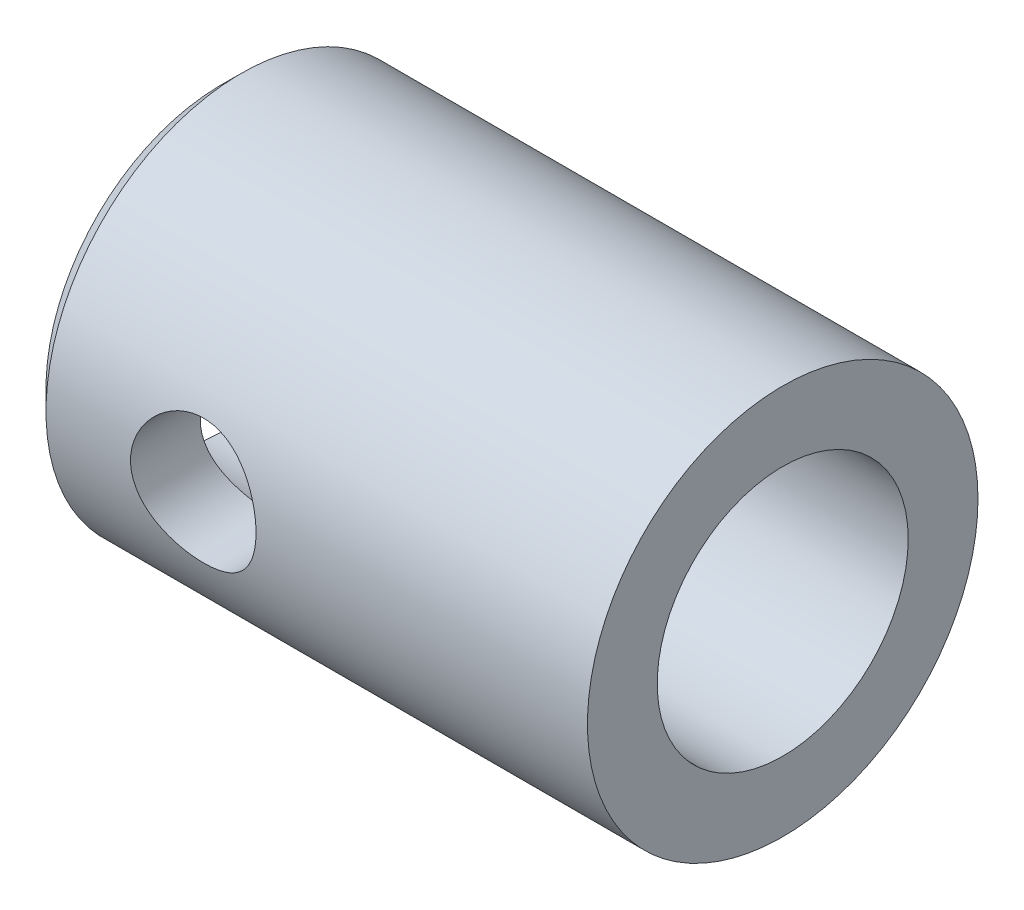
ISO-10303-21;
HEADER;
FILE_DESCRIPTION(('STEP AP214'),'2;1');
FILE_NAME('part.step','',(''),(''),'','','');
FILE_SCHEMA(('AUTOMOTIVE_DESIGN { 1 0 10303 214 1 1 1 1 }'));
ENDSEC;
DATA;
#1=APPLICATION_CONTEXT('core data for automotive mechanical design processes');
#2=APPLICATION_PROTOCOL_DEFINITION('international standard','automotive_design',2000,#1);
#3=PRODUCT_CONTEXT('',#1,'mechanical');
#4=PRODUCT('Part','Part','',(#3));
#5=PRODUCT_RELATED_PRODUCT_CATEGORY('part','',(#4));
#6=PRODUCT_DEFINITION_FORMATION('','',#4);
#7=PRODUCT_DEFINITION_CONTEXT('part definition',#1,'design');
#8=PRODUCT_DEFINITION('design','',#6,#7);
#9=PRODUCT_DEFINITION_SHAPE('','',#8);
#10=(LENGTH_UNIT() NAMED_UNIT(*) SI_UNIT(.MILLI.,.METRE.));
#11=(NAMED_UNIT(*) PLANE_ANGLE_UNIT() SI_UNIT($,.RADIAN.));
#12=(NAMED_UNIT(*) SI_UNIT($,.STERADIAN.) SOLID_ANGLE_UNIT());
#13=UNCERTAINTY_MEASURE_WITH_UNIT(LENGTH_MEASURE(1.E-05),#10,'distance_accuracy_value','');
#14=(GEOMETRIC_REPRESENTATION_CONTEXT(3) GLOBAL_UNCERTAINTY_ASSIGNED_CONTEXT((#13)) GLOBAL_UNIT_ASSIGNED_CONTEXT((#10,
#11,#12)) REPRESENTATION_CONTEXT('',''));
#15=CARTESIAN_POINT('',(0.,0.,0.));
#16=DIRECTION('',(0.,0.,1.));
#17=DIRECTION('',(1.,0.,0.));
#18=AXIS2_PLACEMENT_3D('',#15,#16,#17);
#19=CARTESIAN_POINT('',(42.6212,0.,0.));
#20=DIRECTION('',(-1.,0.,0.));
#21=DIRECTION('',(0.,0.,1.));
#22=AXIS2_PLACEMENT_3D('',#19,#20,#21);
#23=CYLINDRICAL_SURFACE('',#22,14.8209);
#24=CARTESIAN_POINT('',(1.524,0.,0.));
#25=DIRECTION('',(1.,0.,0.));
#26=DIRECTION('',(0.,0.,-1.));
#27=AXIS2_PLACEMENT_3D('',#24,#25,#26);
#28=CIRCLE('',#27,14.8209);
#29=CARTESIAN_POINT('',(1.524,0.,-14.8209));
#30=VERTEX_POINT('',#29);
#31=EDGE_CURVE('E43',#30,#30,#28,.T.);
#32=ORIENTED_EDGE('',*,*,#31,.T.);
#33=EDGE_LOOP('',(#32));
#34=FACE_BOUND('',#33,.T.);
#35=CARTESIAN_POINT('',(17.4625,0.,-14.8209));
#36=CARTESIAN_POINT('',(17.4624994568898,0.260379632540538,-14.8208994870774));
#37=CARTESIAN_POINT('',(17.441076432163,0.520766667672441,-14.8139741654203));
#38=CARTESIAN_POINT('',(17.3561905956567,1.03390288474762,-14.7870276731749));
#39=CARTESIAN_POINT('',(17.2927204390256,1.28665072419858,-14.7670042145936));
#40=CARTESIAN_POINT('',(17.1261181856613,1.77703577522513,-14.7160440036639));
#41=CARTESIAN_POINT('',(17.0230495454601,2.01469645755133,-14.6851247183953));
#42=CARTESIAN_POINT('',(16.7804530953361,2.46936067618328,-14.6155499989599));
#43=CARTESIAN_POINT('',(16.6409189183004,2.68636059595301,-14.5768932140529));
#44=CARTESIAN_POINT('',(16.3245892145734,3.10058748587332,-14.4945288141505));
#45=CARTESIAN_POINT('',(16.1468230676751,3.297050322045,-14.4507065255155));
#46=CARTESIAN_POINT('',(15.7611408847233,3.65795005193175,-14.3636002866809));
#47=CARTESIAN_POINT('',(15.5532188347981,3.82238054220101,-14.3203164457357));
#48=CARTESIAN_POINT('',(15.1064020068003,4.11878189169116,-14.2379444622202));
#49=CARTESIAN_POINT('',(14.8668348736236,4.24978206178781,-14.1989971198325));
#50=CARTESIAN_POINT('',(14.3676161007407,4.46931254458501,-14.1314405143514));
#51=CARTESIAN_POINT('',(14.1079701221452,4.55785477771673,-14.1028283501251));
#52=CARTESIAN_POINT('',(13.5846154886372,4.68713044143014,-14.0603844870467));
#53=CARTESIAN_POINT('',(13.321295088825,4.72928745710386,-14.0461139148853));
#54=CARTESIAN_POINT('',(12.7909617755575,4.76904477457392,-14.0326679681178));
#55=CARTESIAN_POINT('',(12.5239499305168,4.76665770971733,-14.0334883135078));
#56=CARTESIAN_POINT('',(12.0057390692271,4.71850465891803,-14.0497452807499));
#57=CARTESIAN_POINT('',(11.754347424386,4.6745680905365,-14.0645654625477));
#58=CARTESIAN_POINT('',(11.2627125743837,4.54753698121588,-14.1061477920967));
#59=CARTESIAN_POINT('',(11.0224706194958,4.46443806039434,-14.1329112755581));
#60=CARTESIAN_POINT('',(10.5556811118795,4.260188936406,-14.1958231057565));
#61=CARTESIAN_POINT('',(10.3293982047725,4.13847788717477,-14.2321083208656));
#62=CARTESIAN_POINT('',(9.89987678542028,3.8608488278145,-14.3099147211061));
#63=CARTESIAN_POINT('',(9.69664456674573,3.7049215094967,-14.3514373297079));
#64=CARTESIAN_POINT('',(9.3086767060672,3.35438860049305,-14.4374930753061));
#65=CARTESIAN_POINT('',(9.12530831346216,3.15827876765737,-14.4820747598007));
#66=CARTESIAN_POINT('',(8.79371884477358,2.73753927067851,-14.5674628766447));
#67=CARTESIAN_POINT('',(8.6455006796846,2.51290724681063,-14.6082689961472));
#68=CARTESIAN_POINT('',(8.38742081373202,2.03875477190374,-14.6819799442065));
#69=CARTESIAN_POINT('',(8.27790194507404,1.78903586467793,-14.7148133820602));
#70=CARTESIAN_POINT('',(8.10284003410812,1.27341573340948,-14.7683631351214));
#71=CARTESIAN_POINT('',(8.0372828400312,1.00751974704727,-14.7890833494393));
#72=CARTESIAN_POINT('',(7.95437301431391,0.478685957971309,-14.8154368909473));
#73=CARTESIAN_POINT('',(7.93517091289176,0.216066530617194,-14.821648724673));
#74=CARTESIAN_POINT('',(7.94027934253679,-0.308679544883435,-14.8200065948253));
#75=CARTESIAN_POINT('',(7.96458310992208,-0.570806263287368,-14.8121548176646));
#76=CARTESIAN_POINT('',(8.05453715352026,-1.07988052368955,-14.7836486551876));
#77=CARTESIAN_POINT('',(8.11907247572592,-1.3270463011818,-14.7633397363062));
#78=CARTESIAN_POINT('',(8.28628329410422,-1.8069607471473,-14.7123164409879));
#79=CARTESIAN_POINT('',(8.38896357441635,-2.03970760292579,-14.6816007593777));
#80=CARTESIAN_POINT('',(8.63243500501104,-2.49071229522931,-14.6119418282365));
#81=CARTESIAN_POINT('',(8.77412203869248,-2.70845665104474,-14.5728106086226));
#82=CARTESIAN_POINT('',(9.09051970720626,-3.11769139063607,-14.4907801241504));
#83=CARTESIAN_POINT('',(9.26523977927065,-3.30917424470508,-14.4478797843691));
#84=CARTESIAN_POINT('',(9.65144464208988,-3.66881691133028,-14.3608690353941));
#85=CARTESIAN_POINT('',(9.86416636109497,-3.83565756619151,-14.3167835897423));
#86=CARTESIAN_POINT('',(10.3155423757128,-4.13141116249558,-14.234260578872));
#87=CARTESIAN_POINT('',(10.5541964961755,-4.26032436008263,-14.1958229755115));
#88=CARTESIAN_POINT('',(11.0503986432872,-4.47583771985573,-14.1293562643623));
#89=CARTESIAN_POINT('',(11.307883636471,-4.56257222603545,-14.101294178726));
#90=CARTESIAN_POINT('',(11.8349007826344,-4.6911082781992,-14.0590627844038));
#91=CARTESIAN_POINT('',(12.1044279598535,-4.73292820701743,-14.0448877921564));
#92=CARTESIAN_POINT('',(12.6340236936722,-4.76907921792591,-14.0326506550583));
#93=CARTESIAN_POINT('',(12.8939285272709,-4.76558476462151,-14.0338506868682));
#94=CARTESIAN_POINT('',(13.4092481293564,-4.71649817783896,-14.0504226758858));
#95=CARTESIAN_POINT('',(13.6646631297328,-4.67090822504483,-14.0657938989797));
#96=CARTESIAN_POINT('',(14.1596188926047,-4.54041623751517,-14.1084463325416));
#97=CARTESIAN_POINT('',(14.3993511693226,-4.45617049265204,-14.1355282949234));
#98=CARTESIAN_POINT('',(14.8614669827861,-4.25128081128393,-14.1984901114044));
#99=CARTESIAN_POINT('',(15.0838468373501,-4.13062917574718,-14.2343718261536));
#100=CARTESIAN_POINT('',(15.5148290685005,-3.8505675105062,-14.3127267296991));
#101=CARTESIAN_POINT('',(15.7224915860729,-3.68977015482477,-14.355409984133));
#102=CARTESIAN_POINT('',(16.1085895660004,-3.3363824360228,-14.4416295682906));
#103=CARTESIAN_POINT('',(16.287017002617,-3.1437833715994,-14.4851661286072));
#104=CARTESIAN_POINT('',(16.6158923424844,-2.72410038702631,-14.5700278502709));
#105=CARTESIAN_POINT('',(16.7651327963753,-2.49604046865006,-14.6112210327469));
#106=CARTESIAN_POINT('',(17.0229734736995,-2.01675226312417,-14.6850416829891));
#107=CARTESIAN_POINT('',(17.1315873891463,-1.76553181721211,-14.717672035504));
#108=CARTESIAN_POINT('',(17.2985757906004,-1.2646696824813,-14.7688418015036));
#109=CARTESIAN_POINT('',(17.3598622635924,-1.01608038683331,-14.7881879544725));
#110=CARTESIAN_POINT('',(17.4418199402687,-0.511661984513674,-14.8142158417942));
#111=CARTESIAN_POINT('',(17.46250053363,-0.25583456546406,-14.8209005039692));
#112=CARTESIAN_POINT('',(17.4625,0.,-14.8209));
#113=B_SPLINE_CURVE_WITH_KNOTS('',3,(#35,#36,#37,#38,#39,#40,#41,#42,#43,#44,#45,#46,#47,#48,
#49,#50,#51,#52,#53,#54,#55,#56,#57,#58,#59,#60,#61,#62,#63,#64,#65,#66,#67,#68,#69,#70,#71,#72,
#73,#74,#75,#76,#77,#78,#79,#80,#81,#82,#83,#84,#85,#86,#87,#88,#89,#90,#91,#92,#93,#94,#95,#96,
#97,#98,#99,#100,#101,#102,#103,#104,#105,#106,#107,#108,#109,#110,#111,#112),.UNSPECIFIED.,.T.,
.F.,(4,2,2,2,2,2,2,2,2,2,2,2,2,2,2,2,2,2,2,2,2,2,2,2,2,2,2,2,2,2,2,2,2,2,2,2,2,2,4),(0.,
0.780198076947043,1.56053247593218,2.33962157076807,3.11884679046867,3.92086718480861,
4.72304774337463,5.546389360079,6.36949968099873,7.16657550307212,7.96342526632257,
8.72674714385706,9.49015441089364,10.2652012679815,11.040459230666,11.853156995098,
12.6659220402682,13.4857166834991,14.3052472985522,15.0914968212611,15.877624119545,
16.6428784029628,17.4082286969709,18.1928819826534,18.9777597761551,19.7956385621071,
20.6135118243638,21.4287627202142,22.2436798193155,23.0196429521042,23.7955658897297,
24.558776814022,25.3221492536114,26.1168476624428,26.9117638710462,27.7346903617517,
28.5573392581768,29.3240958816171,30.0906751798676),.UNSPECIFIED.);
#114=CARTESIAN_POINT('',(17.4625,0.,-14.8209));
#115=VERTEX_POINT('',#114);
#116=EDGE_CURVE('E47',#115,#115,#113,.T.);
#117=ORIENTED_EDGE('',*,*,#116,.T.);
#118=EDGE_LOOP('',(#117));
#119=FACE_BOUND('',#118,.T.);
#120=CARTESIAN_POINT('',(17.4625,0.,14.8209));
#121=CARTESIAN_POINT('',(17.4624994568898,-0.260379632540538,14.8208994870774));
#122=CARTESIAN_POINT('',(17.441076432163,-0.520766667672441,14.8139741654203));
#123=CARTESIAN_POINT('',(17.3561905956567,-1.03390288474762,14.7870276731749));
#124=CARTESIAN_POINT('',(17.2927204390256,-1.28665072419858,14.7670042145936));
#125=CARTESIAN_POINT('',(17.1261181856613,-1.77703577522513,14.7160440036639));
#126=CARTESIAN_POINT('',(17.0230495454601,-2.01469645755133,14.6851247183953));
#127=CARTESIAN_POINT('',(16.7804530953361,-2.46936067618328,14.6155499989599));
#128=CARTESIAN_POINT('',(16.6409189183004,-2.68636059595301,14.5768932140529));
#129=CARTESIAN_POINT('',(16.3245892145734,-3.10058748587332,14.4945288141505));
#130=CARTESIAN_POINT('',(16.1468230676751,-3.297050322045,14.4507065255155));
#131=CARTESIAN_POINT('',(15.7611408847233,-3.65795005193175,14.3636002866809));
#132=CARTESIAN_POINT('',(15.5532188347981,-3.82238054220101,14.3203164457357));
#133=CARTESIAN_POINT('',(15.1064020068003,-4.11878189169116,14.2379444622202));
#134=CARTESIAN_POINT('',(14.8668348736236,-4.24978206178781,14.1989971198325));
#135=CARTESIAN_POINT('',(14.3676161007407,-4.46931254458501,14.1314405143514));
#136=CARTESIAN_POINT('',(14.1079701221452,-4.55785477771673,14.1028283501251));
#137=CARTESIAN_POINT('',(13.5846154886372,-4.68713044143014,14.0603844870467));
#138=CARTESIAN_POINT('',(13.321295088825,-4.72928745710386,14.0461139148853));
#139=CARTESIAN_POINT('',(12.7909617755575,-4.76904477457392,14.0326679681178));
#140=CARTESIAN_POINT('',(12.5239499305168,-4.76665770971733,14.0334883135078));
#141=CARTESIAN_POINT('',(12.0057390692271,-4.71850465891803,14.0497452807499));
#142=CARTESIAN_POINT('',(11.754347424386,-4.6745680905365,14.0645654625477));
#143=CARTESIAN_POINT('',(11.2627125743837,-4.54753698121588,14.1061477920967));
#144=CARTESIAN_POINT('',(11.0224706194958,-4.46443806039434,14.1329112755581));
#145=CARTESIAN_POINT('',(10.5556811118795,-4.260188936406,14.1958231057565));
#146=CARTESIAN_POINT('',(10.3293982047725,-4.13847788717477,14.2321083208656));
#147=CARTESIAN_POINT('',(9.89987678542028,-3.8608488278145,14.3099147211061));
#148=CARTESIAN_POINT('',(9.69664456674573,-3.7049215094967,14.3514373297079));
#149=CARTESIAN_POINT('',(9.3086767060672,-3.35438860049305,14.4374930753061));
#150=CARTESIAN_POINT('',(9.12530831346216,-3.15827876765737,14.4820747598007));
#151=CARTESIAN_POINT('',(8.79371884477358,-2.73753927067851,14.5674628766447));
#152=CARTESIAN_POINT('',(8.6455006796846,-2.51290724681063,14.6082689961472));
#153=CARTESIAN_POINT('',(8.38742081373202,-2.03875477190374,14.6819799442065));
#154=CARTESIAN_POINT('',(8.27790194507404,-1.78903586467793,14.7148133820602));
#155=CARTESIAN_POINT('',(8.10284003410812,-1.27341573340948,14.7683631351214));
#156=CARTESIAN_POINT('',(8.0372828400312,-1.00751974704727,14.7890833494393));
#157=CARTESIAN_POINT('',(7.95437301431391,-0.478685957971309,14.8154368909473));
#158=CARTESIAN_POINT('',(7.93517091289176,-0.216066530617194,14.821648724673));
#159=CARTESIAN_POINT('',(7.94027934253679,0.308679544883435,14.8200065948253));
#160=CARTESIAN_POINT('',(7.96458310992208,0.570806263287368,14.8121548176646));
#161=CARTESIAN_POINT('',(8.05453715352026,1.07988052368955,14.7836486551876));
#162=CARTESIAN_POINT('',(8.11907247572592,1.3270463011818,14.7633397363062));
#163=CARTESIAN_POINT('',(8.28628329410422,1.8069607471473,14.7123164409879));
#164=CARTESIAN_POINT('',(8.38896357441635,2.03970760292579,14.6816007593777));
#165=CARTESIAN_POINT('',(8.63243500501104,2.49071229522931,14.6119418282365));
#166=CARTESIAN_POINT('',(8.77412203869248,2.70845665104474,14.5728106086226));
#167=CARTESIAN_POINT('',(9.09051970720626,3.11769139063607,14.4907801241504));
#168=CARTESIAN_POINT('',(9.26523977927065,3.30917424470508,14.4478797843691));
#169=CARTESIAN_POINT('',(9.65144464208988,3.66881691133028,14.3608690353941));
#170=CARTESIAN_POINT('',(9.86416636109497,3.83565756619151,14.3167835897423));
#171=CARTESIAN_POINT('',(10.3155423757128,4.13141116249558,14.234260578872));
#172=CARTESIAN_POINT('',(10.5541964961755,4.26032436008263,14.1958229755115));
#173=CARTESIAN_POINT('',(11.0503986432872,4.47583771985573,14.1293562643623));
#174=CARTESIAN_POINT('',(11.307883636471,4.56257222603545,14.101294178726));
#175=CARTESIAN_POINT('',(11.8349007826344,4.6911082781992,14.0590627844038));
#176=CARTESIAN_POINT('',(12.1044279598535,4.73292820701743,14.0448877921564));
#177=CARTESIAN_POINT('',(12.6340236936722,4.76907921792591,14.0326506550583));
#178=CARTESIAN_POINT('',(12.8939285272709,4.76558476462151,14.0338506868682));
#179=CARTESIAN_POINT('',(13.4092481293564,4.71649817783896,14.0504226758858));
#180=CARTESIAN_POINT('',(13.6646631297328,4.67090822504483,14.0657938989797));
#181=CARTESIAN_POINT('',(14.1596188926047,4.54041623751517,14.1084463325416));
#182=CARTESIAN_POINT('',(14.3993511693226,4.45617049265204,14.1355282949234));
#183=CARTESIAN_POINT('',(14.8614669827861,4.25128081128393,14.1984901114044));
#184=CARTESIAN_POINT('',(15.0838468373501,4.13062917574718,14.2343718261536));
#185=CARTESIAN_POINT('',(15.5148290685005,3.8505675105062,14.3127267296991));
#186=CARTESIAN_POINT('',(15.7224915860729,3.68977015482477,14.355409984133));
#187=CARTESIAN_POINT('',(16.1085895660004,3.3363824360228,14.4416295682906));
#188=CARTESIAN_POINT('',(16.287017002617,3.1437833715994,14.4851661286072));
#189=CARTESIAN_POINT('',(16.6158923424844,2.72410038702631,14.5700278502709));
#190=CARTESIAN_POINT('',(16.7651327963753,2.49604046865006,14.6112210327469));
#191=CARTESIAN_POINT('',(17.0229734736995,2.01675226312417,14.6850416829891));
#192=CARTESIAN_POINT('',(17.1315873891463,1.76553181721211,14.717672035504));
#193=CARTESIAN_POINT('',(17.2985757906004,1.2646696824813,14.7688418015036));
#194=CARTESIAN_POINT('',(17.3598622635924,1.01608038683331,14.7881879544725));
#195=CARTESIAN_POINT('',(17.4418199402687,0.511661984513674,14.8142158417942));
#196=CARTESIAN_POINT('',(17.46250053363,0.25583456546406,14.8209005039692));
#197=CARTESIAN_POINT('',(17.4625,0.,14.8209));
#198=B_SPLINE_CURVE_WITH_KNOTS('',3,(#120,#121,#122,#123,#124,#125,#126,#127,#128,#129,#130,
#131,#132,#133,#134,#135,#136,#137,#138,#139,#140,#141,#142,#143,#144,#145,#146,#147,#148,#149,
#150,#151,#152,#153,#154,#155,#156,#157,#158,#159,#160,#161,#162,#163,#164,#165,#166,#167,#168,
#169,#170,#171,#172,#173,#174,#175,#176,#177,#178,#179,#180,#181,#182,#183,#184,#185,#186,#187,
#188,#189,#190,#191,#192,#193,#194,#195,#196,#197),.UNSPECIFIED.,.T.,.F.,(4,2,2,2,2,2,2,2,2,2,2,
2,2,2,2,2,2,2,2,2,2,2,2,2,2,2,2,2,2,2,2,2,2,2,2,2,2,2,4),(0.,0.780198076947043,1.56053247593218,
2.33962157076807,3.11884679046867,3.92086718480861,4.72304774337463,5.546389360079,
6.36949968099873,7.16657550307212,7.96342526632257,8.72674714385706,9.49015441089364,
10.2652012679815,11.040459230666,11.853156995098,12.6659220402682,13.4857166834991,
14.3052472985522,15.0914968212611,15.877624119545,16.6428784029628,17.4082286969709,
18.1928819826534,18.9777597761551,19.7956385621071,20.6135118243638,21.4287627202142,
22.2436798193155,23.0196429521042,23.7955658897297,24.558776814022,25.3221492536114,
26.1168476624428,26.9117638710462,27.7346903617517,28.5573392581768,29.3240958816171,
30.0906751798676),.UNSPECIFIED.);
#199=CARTESIAN_POINT('',(17.4625,0.,14.8209));
#200=VERTEX_POINT('',#199);
#201=EDGE_CURVE('E51',#200,#200,#198,.T.);
#202=ORIENTED_EDGE('',*,*,#201,.T.);
#203=EDGE_LOOP('',(#202));
#204=FACE_BOUND('',#203,.T.);
#205=CARTESIAN_POINT('',(42.6212,0.,0.));
#206=DIRECTION('',(1.,0.,0.));
#207=DIRECTION('',(0.,0.,-1.));
#208=AXIS2_PLACEMENT_3D('',#205,#206,#207);
#209=CIRCLE('',#208,14.8209);
#210=CARTESIAN_POINT('',(42.6212,0.,-14.8209));
#211=VERTEX_POINT('',#210);
#212=EDGE_CURVE('E94',#211,#211,#209,.T.);
#213=ORIENTED_EDGE('',*,*,#212,.F.);
#214=EDGE_LOOP('',(#213));
#215=FACE_BOUND('',#214,.T.);
#216=ADVANCED_FACE('F36',(#34,#119,#204,#215),#23,.T.);
#217=CARTESIAN_POINT('',(42.6212,0.,0.));
#218=DIRECTION('',(1.,0.,0.));
#219=DIRECTION('',(0.,0.,-1.));
#220=AXIS2_PLACEMENT_3D('',#217,#218,#219);
#221=PLANE('',#220);
#222=CARTESIAN_POINT('',(42.6212,0.,0.));
#223=DIRECTION('',(1.,0.,0.));
#224=DIRECTION('',(0.,0.,-1.));
#225=AXIS2_PLACEMENT_3D('',#222,#223,#224);
#226=CIRCLE('',#225,9.52500000000001);
#227=CARTESIAN_POINT('',(42.6212,0.,-9.52500000000001));
#228=VERTEX_POINT('',#227);
#229=EDGE_CURVE('E89',#228,#228,#226,.T.);
#230=ORIENTED_EDGE('',*,*,#229,.F.);
#231=EDGE_LOOP('',(#230));
#232=FACE_BOUND('',#231,.T.);
#233=ORIENTED_EDGE('',*,*,#212,.T.);
#234=EDGE_LOOP('',(#233));
#235=FACE_BOUND('',#234,.T.);
#236=ADVANCED_FACE('F115',(#232,#235),#221,.T.);
#237=CARTESIAN_POINT('',(0.,0.,0.));
#238=DIRECTION('',(1.,0.,0.));
#239=DIRECTION('',(0.,0.,-1.));
#240=AXIS2_PLACEMENT_3D('',#237,#238,#239);
#241=PLANE('',#240);
#242=CARTESIAN_POINT('',(0.,0.,0.));
#243=DIRECTION('',(1.,0.,0.));
#244=DIRECTION('',(0.,0.,-1.));
#245=AXIS2_PLACEMENT_3D('',#242,#243,#244);
#246=CIRCLE('',#245,13.2969);
#247=CARTESIAN_POINT('',(0.,0.,-13.2969));
#248=VERTEX_POINT('',#247);
#249=EDGE_CURVE('E11',#248,#248,#246,.F.);
#250=ORIENTED_EDGE('',*,*,#249,.T.);
#251=EDGE_LOOP('',(#250));
#252=FACE_BOUND('',#251,.T.);
#253=CARTESIAN_POINT('',(0.,0.,0.));
#254=DIRECTION('',(1.,0.,0.));
#255=DIRECTION('',(0.,0.,-1.));
#256=AXIS2_PLACEMENT_3D('',#253,#254,#255);
#257=CIRCLE('',#256,9.52500000000001);
#258=CARTESIAN_POINT('',(0.,0.,-9.52500000000001));
#259=VERTEX_POINT('',#258);
#260=EDGE_CURVE('E92',#259,#259,#257,.T.);
#261=ORIENTED_EDGE('',*,*,#260,.T.);
#262=EDGE_LOOP('',(#261));
#263=FACE_BOUND('',#262,.T.);
#264=ADVANCED_FACE('F109',(#252,#263),#241,.F.);
#265=CARTESIAN_POINT('',(42.6212,0.,0.));
#266=DIRECTION('',(1.,0.,0.));
#267=DIRECTION('',(0.,0.,-1.));
#268=AXIS2_PLACEMENT_3D('',#265,#266,#267);
#269=CYLINDRICAL_SURFACE('',#268,9.52500000000001);
#270=CARTESIAN_POINT('',(7.93749999999999,0.,-9.52500000000001));
#271=CARTESIAN_POINT('',(7.93750041168576,0.125243167799989,-9.52499962063722));
#272=CARTESIAN_POINT('',(7.94244611845907,0.250495089131835,-9.52252400598024));
#273=CARTESIAN_POINT('',(7.9621725066417,0.500076393496527,-9.51268396387998));
#274=CARTESIAN_POINT('',(7.97695746658016,0.624405351393147,-9.50531740964973));
#275=CARTESIAN_POINT('',(8.01621534245217,0.87133100126815,-9.48587193787976));
#276=CARTESIAN_POINT('',(8.04070207427199,0.9939249635233,-9.47378630044848));
#277=CARTESIAN_POINT('',(8.09909226561662,1.23637011508467,-9.44520637539278));
#278=CARTESIAN_POINT('',(8.13299957477862,1.35622016139572,-9.42871028557933));
#279=CARTESIAN_POINT('',(8.20970400453507,1.59183120722171,-9.3917969722246));
#280=CARTESIAN_POINT('',(8.25246188774284,1.70760770137533,-9.37139708461429));
#281=CARTESIAN_POINT('',(8.34654997991027,1.93495086483046,-9.32711267183551));
#282=CARTESIAN_POINT('',(8.39788341520112,2.04651593025001,-9.30322683559749));
#283=CARTESIAN_POINT('',(8.56405414657062,2.37384489745524,-9.22716144615756));
#284=CARTESIAN_POINT('',(8.69114731154532,2.58250225923314,-9.17053150857181));
#285=CARTESIAN_POINT('',(8.98296903034919,2.98854538583361,-9.0466608191016));
#286=CARTESIAN_POINT('',(9.14950928234912,3.18448556312959,-8.9789854011414));
#287=CARTESIAN_POINT('',(9.5115911067321,3.54699697455441,-8.84205954293003));
#288=CARTESIAN_POINT('',(9.70715457207316,3.71354582861884,-8.77280794740668));
#289=CARTESIAN_POINT('',(10.1401325773848,4.02553537328568,-8.63435408613188));
#290=CARTESIAN_POINT('',(10.3796165492564,4.16833749963763,-8.56557212539104));
#291=CARTESIAN_POINT('',(10.7568219383726,4.35029005345509,-8.47379640254793));
#292=CARTESIAN_POINT('',(10.885600174953,4.40557901885788,-8.44509626519092));
#293=CARTESIAN_POINT('',(11.1483786891223,4.50483773649695,-8.39256904955605));
#294=CARTESIAN_POINT('',(11.2823758204614,4.54881419057648,-8.36873908777995));
#295=CARTESIAN_POINT('',(11.5465156092971,4.62261399582859,-8.32818911059646));
#296=CARTESIAN_POINT('',(11.6764154219076,4.65312214328154,-8.31113119648639));
#297=CARTESIAN_POINT('',(11.9388816871418,4.70318378391282,-8.28290506375684));
#298=CARTESIAN_POINT('',(12.0714466861774,4.72274308921003,-8.27173372047613));
#299=CARTESIAN_POINT('',(12.3380572544552,4.7506165346424,-8.25575723957706));
#300=CARTESIAN_POINT('',(12.4721018829136,4.75893744712048,-8.25094826797977));
#301=CARTESIAN_POINT('',(12.740481819319,4.76421854927813,-8.24790017307782));
#302=CARTESIAN_POINT('',(12.8748170983105,4.76117982286955,-8.24966042295242));
#303=CARTESIAN_POINT('',(13.1264394630534,4.74483797280583,-8.25906842780932));
#304=CARTESIAN_POINT('',(13.2438387327312,4.73280973448219,-8.26598467895692));
#305=CARTESIAN_POINT('',(13.4770633257449,4.70015601149781,-8.28459407928507));
#306=CARTESIAN_POINT('',(13.5928881429293,4.67952782662533,-8.29628872876443));
#307=CARTESIAN_POINT('',(13.9367964051027,4.60506661909893,-8.33800444414718));
#308=CARTESIAN_POINT('',(14.1614867785852,4.53864529577752,-8.374664603912));
#309=CARTESIAN_POINT('',(14.6013642274574,4.37297035741613,-8.46236620531706));
#310=CARTESIAN_POINT('',(14.8162080350256,4.27298801966147,-8.51372273880605));
#311=CARTESIAN_POINT('',(15.2271375039129,4.04355977442937,-8.62505005190896));
#312=CARTESIAN_POINT('',(15.4232146831728,3.91410063264099,-8.68502469635286));
#313=CARTESIAN_POINT('',(15.8171549310346,3.61029947812719,-8.81601207894061));
#314=CARTESIAN_POINT('',(16.0120920201443,3.43234782914614,-8.8874601733149));
#315=CARTESIAN_POINT('',(16.3706487814701,3.04584295330872,-9.02721381532403));
#316=CARTESIAN_POINT('',(16.5342534865606,2.83727518509306,-9.09551784930111));
#317=CARTESIAN_POINT('',(16.7561653266372,2.49965137796344,-9.19195370403878));
#318=CARTESIAN_POINT('',(16.8275179703175,2.38002127368373,-9.22372787983905));
#319=CARTESIAN_POINT('',(16.959778213682,2.13427687141612,-9.28366556941999));
#320=CARTESIAN_POINT('',(17.0206902164603,2.00816533613018,-9.31183060399967));
#321=CARTESIAN_POINT('',(17.1314099554822,1.75034069526616,-9.3637184492558));
#322=CARTESIAN_POINT('',(17.1812221618152,1.61862987016266,-9.38744304755808));
#323=CARTESIAN_POINT('',(17.2691662378217,1.3505610663951,-9.42974072645534));
#324=CARTESIAN_POINT('',(17.3072994511732,1.21420362433566,-9.44831439964531));
#325=CARTESIAN_POINT('',(17.3687107209177,0.949450109300049,-9.47841891468133));
#326=CARTESIAN_POINT('',(17.3929575138712,0.821329961906903,-9.49040564136938));
#327=CARTESIAN_POINT('',(17.4308846588151,0.563164063018347,-9.50921741531496));
#328=CARTESIAN_POINT('',(17.4445659448694,0.433118482780758,-9.51604291885925));
#329=CARTESIAN_POINT('',(17.461179036958,0.172222200636556,-9.52433687415142));
#330=CARTESIAN_POINT('',(17.4641149583215,0.0413718261918259,-9.52580737679105));
#331=CARTESIAN_POINT('',(17.4592085658102,-0.220072847166311,-9.52335444060486));
#332=CARTESIAN_POINT('',(17.451366728936,-0.350667157156421,-9.51943124049281));
#333=CARTESIAN_POINT('',(17.4260395631741,-0.600383632816328,-9.50681651861089));
#334=CARTESIAN_POINT('',(17.4093520453444,-0.719607798059655,-9.49851975936575));
#335=CARTESIAN_POINT('',(17.3670838139219,-0.95612355847633,-9.47763434053447));
#336=CARTESIAN_POINT('',(17.3415002835031,-1.07341452918895,-9.46504432155855));
#337=CARTESIAN_POINT('',(17.2817129440978,-1.30523272581463,-9.43586934009924));
#338=CARTESIAN_POINT('',(17.2475117729942,-1.41976078572847,-9.41928560017323));
#339=CARTESIAN_POINT('',(17.1708176763395,-1.64542419391327,-9.38249998161802));
#340=CARTESIAN_POINT('',(17.1283215744865,-1.75655822362736,-9.36229671724177));
#341=CARTESIAN_POINT('',(16.9862997139752,-2.09007412634845,-9.29566539786796));
#342=CARTESIAN_POINT('',(16.8739114434498,-2.30611033108621,-9.24405921515467));
#343=CARTESIAN_POINT('',(16.6190115359582,-2.71685918550571,-9.13180205397677));
#344=CARTESIAN_POINT('',(16.4764870666523,-2.91156269769227,-9.07114722574503));
#345=CARTESIAN_POINT('',(16.1492051052876,-3.29452731372962,-8.9396078388598));
#346=CARTESIAN_POINT('',(15.9616747138558,-3.48027815582499,-8.86830363142301));
#347=CARTESIAN_POINT('',(15.5578138133799,-3.81886460963265,-8.72786114875585));
#348=CARTESIAN_POINT('',(15.3414635473916,-3.97167745144759,-8.65872439991559));
#349=CARTESIAN_POINT('',(14.9931527356666,-4.17638881115549,-8.56092960704945));
#350=CARTESIAN_POINT('',(14.8699370419974,-4.24173741059433,-8.52864647367418));
#351=CARTESIAN_POINT('',(14.617483369008,-4.36167001930207,-8.46793790675363));
#352=CARTESIAN_POINT('',(14.4882481503419,-4.41625890421416,-8.43951072775553));
#353=CARTESIAN_POINT('',(14.2246886238527,-4.51403084118842,-8.38762286815761));
#354=CARTESIAN_POINT('',(14.0903685783981,-4.55722321448888,-8.3641581318998));
#355=CARTESIAN_POINT('',(13.8175767817094,-4.63167416627275,-8.32316235190996));
#356=CARTESIAN_POINT('',(13.6791056768868,-4.66293459251875,-8.30563038948563));
#357=CARTESIAN_POINT('',(13.4126938550876,-4.71062527640279,-8.27866590076997));
#358=CARTESIAN_POINT('',(13.2850179913282,-4.72819092555357,-8.26861751501086));
#359=CARTESIAN_POINT('',(13.0283408034732,-4.75291664228843,-8.25443000373948));
#360=CARTESIAN_POINT('',(12.8993396196761,-4.76007780009146,-8.25029025909994));
#361=CARTESIAN_POINT('',(12.6411765289331,-4.76388567177542,-8.24809207938037));
#362=CARTESIAN_POINT('',(12.5120146944407,-4.76053608147039,-8.25003150672728));
#363=CARTESIAN_POINT('',(12.2546247560547,-4.7433830792926,-8.25990551900991));
#364=CARTESIAN_POINT('',(12.1263966141529,-4.72958009537706,-8.2678398585166));
#365=CARTESIAN_POINT('',(11.8841264074435,-4.69353669139924,-8.28834856879424));
#366=CARTESIAN_POINT('',(11.7699003619582,-4.67222934629289,-8.30040666790684));
#367=CARTESIAN_POINT('',(11.5437972159845,-4.62147643847893,-8.32877048505192));
#368=CARTESIAN_POINT('',(11.4319208534093,-4.59202835912459,-8.34507751652015));
#369=CARTESIAN_POINT('',(11.100831447855,-4.49189766535447,-8.39966155854961));
#370=CARTESIAN_POINT('',(10.8860055695258,-4.40940547807409,-8.44361545117002));
#371=CARTESIAN_POINT('',(10.4586147739473,-4.20916574352958,-8.54528603634262));
#372=CARTESIAN_POINT('',(10.2471714576201,-4.08942191082136,-8.60372898549139));
#373=CARTESIAN_POINT('',(9.84596318561007,-3.82024338512735,-8.72658246261698));
#374=CARTESIAN_POINT('',(9.65620958951942,-3.67079324521366,-8.79099608593485));
#375=CARTESIAN_POINT('',(9.27985076480663,-3.32520368388597,-8.92789150982253));
#376=CARTESIAN_POINT('',(9.09642959212383,-3.12559766366326,-9.00040265167882));
#377=CARTESIAN_POINT('',(8.76490396382292,-2.69626914168463,-9.13818513010388));
#378=CARTESIAN_POINT('',(8.61681854444924,-2.46653050955161,-9.20345255422176));
#379=CARTESIAN_POINT('',(8.42457953016319,-2.10268072495819,-9.29086610240479));
#380=CARTESIAN_POINT('',(8.36529910686542,-1.97763300723183,-9.31834760006231));
#381=CARTESIAN_POINT('',(8.25760081129533,-1.72211552262134,-9.36893044835915));
#382=CARTESIAN_POINT('',(8.20917760256958,-1.59164845695407,-9.39203394996842));
#383=CARTESIAN_POINT('',(8.12386096995524,-1.32654199767926,-9.43312646132605));
#384=CARTESIAN_POINT('',(8.08694239892919,-1.19191242135595,-9.45112661821366));
#385=CARTESIAN_POINT('',(8.02499893955418,-0.919388438520271,-9.48151473751692));
#386=CARTESIAN_POINT('',(7.99996678591799,-0.781496080561077,-9.49390612793917));
#387=CARTESIAN_POINT('',(7.96657550827107,-0.536297175823774,-9.5104875945448));
#388=CARTESIAN_POINT('',(7.95568155460834,-0.42941158376785,-9.51592021375588));
#389=CARTESIAN_POINT('',(7.94114352371672,-0.215019489362878,-9.5231766291168));
#390=CARTESIAN_POINT('',(7.937499646595,-0.107512969957934,-9.52500032565786));
#391=CARTESIAN_POINT('',(7.93749999999999,0.,-9.52500000000001));
#392=B_SPLINE_CURVE_WITH_KNOTS('',3,(#270,#271,#272,#273,#274,#275,#276,#277,#278,#279,#280,
#281,#282,#283,#284,#285,#286,#287,#288,#289,#290,#291,#292,#293,#294,#295,#296,#297,#298,#299,
#300,#301,#302,#303,#304,#305,#306,#307,#308,#309,#310,#311,#312,#313,#314,#315,#316,#317,#318,
#319,#320,#321,#322,#323,#324,#325,#326,#327,#328,#329,#330,#331,#332,#333,#334,#335,#336,#337,
#338,#339,#340,#341,#342,#343,#344,#345,#346,#347,#348,#349,#350,#351,#352,#353,#354,#355,#356,
#357,#358,#359,#360,#361,#362,#363,#364,#365,#366,#367,#368,#369,#370,#371,#372,#373,#374,#375,
#376,#377,#378,#379,#380,#381,#382,#383,#384,#385,#386,#387,#388,#389,#390,#391),.UNSPECIFIED.,
.T.,.F.,(4,2,2,2,2,2,2,2,2,2,2,2,2,2,2,2,2,2,2,2,2,2,2,2,2,2,2,2,2,2,2,2,2,2,2,2,2,2,2,2,2,2,2,
2,2,2,2,2,2,2,2,2,2,2,2,2,2,2,2,2,4),(0.,0.375623418154021,0.751410280296023,1.12773421934006,
1.50421216665563,1.87905550525342,2.25404018794787,3.00318908218552,3.7976597983107,
4.59273287924315,5.4494638936804,5.87811905389961,6.3065196790929,6.70950847539316,
7.11228314445238,7.51481498990847,7.91730842763881,8.27152461989835,8.62585211283936,
9.33399259637597,10.0586277474397,10.7835888844336,11.6004728904415,12.417746144678,
12.8458801890468,13.2738332313566,13.701613616489,14.1293447666274,14.521651524315,
14.913923595397,15.3060454158579,15.698149882404,16.0597456619957,16.4214560413944,
16.7830558344937,17.1447943642861,17.8882174899416,18.6319578135026,19.4487341785405,
20.2660733794109,20.6950689367829,21.1238696504806,21.5523185520335,21.9807010777177,
22.3679690015927,22.7551963432538,23.1422875423821,23.5293628950278,23.8794231642634,
24.2295917732494,24.9294696536929,25.6763690993089,26.4236579446131,27.2617475314397,
28.1002876036314,28.5230685284025,28.9456411934234,29.3672836019069,29.7886679587936,
30.1111069020891,30.4335547448009),.UNSPECIFIED.);
#393=CARTESIAN_POINT('',(7.93749999999999,0.,-9.52500000000001));
#394=VERTEX_POINT('',#393);
#395=EDGE_CURVE('E83',#394,#394,#392,.T.);
#396=ORIENTED_EDGE('',*,*,#395,.T.);
#397=EDGE_LOOP('',(#396));
#398=FACE_BOUND('',#397,.T.);
#399=CARTESIAN_POINT('',(17.4625,0.,9.52500000000001));
#400=CARTESIAN_POINT('',(17.4624995883142,0.125243167799989,9.52499962063722));
#401=CARTESIAN_POINT('',(17.4575538815409,0.250495089131835,9.52252400598024));
#402=CARTESIAN_POINT('',(17.4378274933583,0.500076393496526,9.51268396387998));
#403=CARTESIAN_POINT('',(17.4230425334198,0.624405351393146,9.50531740964973));
#404=CARTESIAN_POINT('',(17.3837846575478,0.871331001268149,9.48587193787976));
#405=CARTESIAN_POINT('',(17.359297925728,0.993924963523299,9.47378630044848));
#406=CARTESIAN_POINT('',(17.3009077343834,1.23637011508467,9.44520637539278));
#407=CARTESIAN_POINT('',(17.2670004252214,1.35622016139572,9.42871028557933));
#408=CARTESIAN_POINT('',(17.1902959954649,1.59183120722171,9.39179697222461));
#409=CARTESIAN_POINT('',(17.1475381122572,1.70760770137533,9.37139708461429));
#410=CARTESIAN_POINT('',(17.0534500200897,1.93495086483046,9.32711267183551));
#411=CARTESIAN_POINT('',(17.0021165847989,2.04651593025001,9.30322683559749));
#412=CARTESIAN_POINT('',(16.8359458534294,2.37384489745524,9.22716144615756));
#413=CARTESIAN_POINT('',(16.7088526884547,2.58250225923314,9.17053150857181));
#414=CARTESIAN_POINT('',(16.4170309696508,2.98854538583361,9.0466608191016));
#415=CARTESIAN_POINT('',(16.2504907176509,3.18448556312959,8.9789854011414));
#416=CARTESIAN_POINT('',(15.8884088932679,3.54699697455441,8.84205954293003));
#417=CARTESIAN_POINT('',(15.6928454279268,3.71354582861884,8.77280794740668));
#418=CARTESIAN_POINT('',(15.2598674226152,4.02553537328568,8.63435408613188));
#419=CARTESIAN_POINT('',(15.0203834507436,4.16833749963763,8.56557212539104));
#420=CARTESIAN_POINT('',(14.6431780616274,4.35029005345508,8.47379640254793));
#421=CARTESIAN_POINT('',(14.514399825047,4.40557901885788,8.44509626519091));
#422=CARTESIAN_POINT('',(14.2516213108777,4.50483773649695,8.39256904955605));
#423=CARTESIAN_POINT('',(14.1176241795386,4.54881419057648,8.36873908777995));
#424=CARTESIAN_POINT('',(13.8534843907029,4.62261399582859,8.32818911059646));
#425=CARTESIAN_POINT('',(13.7235845780924,4.65312214328154,8.3111311964864));
#426=CARTESIAN_POINT('',(13.4611183128582,4.70318378391281,8.28290506375684));
#427=CARTESIAN_POINT('',(13.3285533138226,4.72274308921003,8.27173372047613));
#428=CARTESIAN_POINT('',(13.0619427455448,4.7506165346424,8.25575723957706));
#429=CARTESIAN_POINT('',(12.9278981170864,4.75893744712048,8.25094826797976));
#430=CARTESIAN_POINT('',(12.659518180681,4.76421854927813,8.24790017307781));
#431=CARTESIAN_POINT('',(12.5251829016895,4.76117982286955,8.24966042295242));
#432=CARTESIAN_POINT('',(12.2735605369466,4.74483797280583,8.25906842780932));
#433=CARTESIAN_POINT('',(12.1561612672688,4.73280973448219,8.26598467895692));
#434=CARTESIAN_POINT('',(11.9229366742551,4.70015601149781,8.28459407928507));
#435=CARTESIAN_POINT('',(11.8071118570707,4.67952782662533,8.29628872876443));
#436=CARTESIAN_POINT('',(11.4632035948973,4.60506661909893,8.33800444414718));
#437=CARTESIAN_POINT('',(11.2385132214148,4.53864529577752,8.374664603912));
#438=CARTESIAN_POINT('',(10.7986357725427,4.37297035741613,8.46236620531705));
#439=CARTESIAN_POINT('',(10.5837919649744,4.27298801966148,8.51372273880605));
#440=CARTESIAN_POINT('',(10.1728624960871,4.04355977442937,8.62505005190896));
#441=CARTESIAN_POINT('',(9.97678531682721,3.914100632641,8.68502469635286));
#442=CARTESIAN_POINT('',(9.58284506896535,3.6102994781272,8.81601207894061));
#443=CARTESIAN_POINT('',(9.38790797985574,3.43234782914614,8.8874601733149));
#444=CARTESIAN_POINT('',(9.02935121852991,3.04584295330872,9.02721381532403));
#445=CARTESIAN_POINT('',(8.86574651343943,2.83727518509306,9.09551784930111));
#446=CARTESIAN_POINT('',(8.64383467336282,2.49965137796344,9.19195370403878));
#447=CARTESIAN_POINT('',(8.57248202968254,2.38002127368374,9.22372787983904));
#448=CARTESIAN_POINT('',(8.44022178631795,2.13427687141612,9.28366556941998));
#449=CARTESIAN_POINT('',(8.37930978353972,2.00816533613018,9.31183060399967));
#450=CARTESIAN_POINT('',(8.26859004451778,1.75034069526616,9.3637184492558));
#451=CARTESIAN_POINT('',(8.21877783818483,1.61862987016267,9.38744304755808));
#452=CARTESIAN_POINT('',(8.1308337621783,1.3505610663951,9.42974072645534));
#453=CARTESIAN_POINT('',(8.09270054882683,1.21420362433567,9.44831439964531));
#454=CARTESIAN_POINT('',(8.03128927908232,0.949450109300054,9.47841891468133));
#455=CARTESIAN_POINT('',(8.00704248612876,0.821329961906908,9.49040564136938));
#456=CARTESIAN_POINT('',(7.96911534118487,0.563164063018352,9.50921741531496));
#457=CARTESIAN_POINT('',(7.95543405513056,0.433118482780763,9.51604291885925));
#458=CARTESIAN_POINT('',(7.93882096304196,0.172222200636561,9.52433687415142));
#459=CARTESIAN_POINT('',(7.93588504167852,0.0413718261918302,9.52580737679105));
#460=CARTESIAN_POINT('',(7.94079143418982,-0.220072847166307,9.52335444060486));
#461=CARTESIAN_POINT('',(7.94863327106402,-0.350667157156416,9.51943124049281));
#462=CARTESIAN_POINT('',(7.97396043682591,-0.600383632816322,9.50681651861089));
#463=CARTESIAN_POINT('',(7.99064795465563,-0.719607798059648,9.49851975936575));
#464=CARTESIAN_POINT('',(8.03291618607805,-0.956123558476322,9.47763434053447));
#465=CARTESIAN_POINT('',(8.05849971649686,-1.07341452918894,9.46504432155855));
#466=CARTESIAN_POINT('',(8.11828705590223,-1.30523272581462,9.43586934009925));
#467=CARTESIAN_POINT('',(8.15248822700575,-1.41976078572846,9.41928560017323));
#468=CARTESIAN_POINT('',(8.22918232366047,-1.64542419391326,9.38249998161802));
#469=CARTESIAN_POINT('',(8.27167842551345,-1.75655822362735,9.36229671724177));
#470=CARTESIAN_POINT('',(8.41370028602478,-2.09007412634845,9.29566539786796));
#471=CARTESIAN_POINT('',(8.52608855655024,-2.3061103310862,9.24405921515467));
#472=CARTESIAN_POINT('',(8.78098846404178,-2.71685918550571,9.13180205397677));
#473=CARTESIAN_POINT('',(8.92351293334767,-2.91156269769227,9.07114722574503));
#474=CARTESIAN_POINT('',(9.25079489471237,-3.29452731372962,8.9396078388598));
#475=CARTESIAN_POINT('',(9.43832528614418,-3.48027815582499,8.86830363142301));
#476=CARTESIAN_POINT('',(9.84218618662008,-3.81886460963264,8.72786114875585));
#477=CARTESIAN_POINT('',(10.0585364526084,-3.97167745144759,8.65872439991559));
#478=CARTESIAN_POINT('',(10.4068472643334,-4.17638881115549,8.56092960704945));
#479=CARTESIAN_POINT('',(10.5300629580026,-4.24173741059432,8.52864647367418));
#480=CARTESIAN_POINT('',(10.7825166309919,-4.36167001930207,8.46793790675363));
#481=CARTESIAN_POINT('',(10.9117518496581,-4.41625890421416,8.43951072775553));
#482=CARTESIAN_POINT('',(11.1753113761473,-4.51403084118842,8.38762286815761));
#483=CARTESIAN_POINT('',(11.3096314216019,-4.55722321448888,8.3641581318998));
#484=CARTESIAN_POINT('',(11.5824232182906,-4.63167416627275,8.32316235190996));
#485=CARTESIAN_POINT('',(11.7208943231132,-4.66293459251875,8.30563038948563));
#486=CARTESIAN_POINT('',(11.9873061449123,-4.71062527640279,8.27866590076997));
#487=CARTESIAN_POINT('',(12.1149820086717,-4.72819092555357,8.26861751501086));
#488=CARTESIAN_POINT('',(12.3716591965267,-4.75291664228843,8.25443000373948));
#489=CARTESIAN_POINT('',(12.5006603803239,-4.76007780009146,8.25029025909994));
#490=CARTESIAN_POINT('',(12.7588234710669,-4.76388567177542,8.24809207938037));
#491=CARTESIAN_POINT('',(12.8879853055593,-4.76053608147039,8.25003150672728));
#492=CARTESIAN_POINT('',(13.1453752439453,-4.7433830792926,8.25990551900991));
#493=CARTESIAN_POINT('',(13.2736033858471,-4.72958009537706,8.2678398585166));
#494=CARTESIAN_POINT('',(13.5158735925565,-4.69353669139924,8.28834856879424));
#495=CARTESIAN_POINT('',(13.6300996380418,-4.67222934629289,8.30040666790683));
#496=CARTESIAN_POINT('',(13.8562027840155,-4.62147643847893,8.32877048505192));
#497=CARTESIAN_POINT('',(13.9680791465907,-4.59202835912459,8.34507751652015));
#498=CARTESIAN_POINT('',(14.299168552145,-4.49189766535447,8.3996615585496));
#499=CARTESIAN_POINT('',(14.5139944304742,-4.4094054780741,8.44361545117001));
#500=CARTESIAN_POINT('',(14.9413852260527,-4.20916574352958,8.54528603634262));
#501=CARTESIAN_POINT('',(15.1528285423799,-4.08942191082136,8.60372898549138));
#502=CARTESIAN_POINT('',(15.5540368143899,-3.82024338512735,8.72658246261698));
#503=CARTESIAN_POINT('',(15.7437904104806,-3.67079324521366,8.79099608593485));
#504=CARTESIAN_POINT('',(16.1201492351934,-3.32520368388598,8.92789150982252));
#505=CARTESIAN_POINT('',(16.3035704078762,-3.12559766366326,9.00040265167882));
#506=CARTESIAN_POINT('',(16.6350960361771,-2.69626914168464,9.13818513010388));
#507=CARTESIAN_POINT('',(16.7831814555508,-2.46653050955161,9.20345255422176));
#508=CARTESIAN_POINT('',(16.9754204698368,-2.1026807249582,9.29086610240479));
#509=CARTESIAN_POINT('',(17.0347008931346,-1.97763300723184,9.3183476000623));
#510=CARTESIAN_POINT('',(17.1423991887047,-1.72211552262135,9.36893044835915));
#511=CARTESIAN_POINT('',(17.1908223974304,-1.59164845695408,9.39203394996842));
#512=CARTESIAN_POINT('',(17.2761390300448,-1.32654199767926,9.43312646132605));
#513=CARTESIAN_POINT('',(17.3130576010708,-1.19191242135596,9.45112661821366));
#514=CARTESIAN_POINT('',(17.3750010604458,-0.919388438520277,9.48151473751692));
#515=CARTESIAN_POINT('',(17.400033214082,-0.781496080561084,9.49390612793917));
#516=CARTESIAN_POINT('',(17.4334244917289,-0.536297175823778,9.51048759454481));
#517=CARTESIAN_POINT('',(17.4443184453917,-0.429411583767853,9.51592021375588));
#518=CARTESIAN_POINT('',(17.4588564762833,-0.215019489362879,9.5231766291168));
#519=CARTESIAN_POINT('',(17.462500353405,-0.107512969957934,9.52500032565786));
#520=CARTESIAN_POINT('',(17.4625,0.,9.52500000000001));
#521=B_SPLINE_CURVE_WITH_KNOTS('',3,(#399,#400,#401,#402,#403,#404,#405,#406,#407,#408,#409,
#410,#411,#412,#413,#414,#415,#416,#417,#418,#419,#420,#421,#422,#423,#424,#425,#426,#427,#428,
#429,#430,#431,#432,#433,#434,#435,#436,#437,#438,#439,#440,#441,#442,#443,#444,#445,#446,#447,
#448,#449,#450,#451,#452,#453,#454,#455,#456,#457,#458,#459,#460,#461,#462,#463,#464,#465,#466,
#467,#468,#469,#470,#471,#472,#473,#474,#475,#476,#477,#478,#479,#480,#481,#482,#483,#484,#485,
#486,#487,#488,#489,#490,#491,#492,#493,#494,#495,#496,#497,#498,#499,#500,#501,#502,#503,#504,
#505,#506,#507,#508,#509,#510,#511,#512,#513,#514,#515,#516,#517,#518,#519,#520),.UNSPECIFIED.,
.T.,.F.,(4,2,2,2,2,2,2,2,2,2,2,2,2,2,2,2,2,2,2,2,2,2,2,2,2,2,2,2,2,2,2,2,2,2,2,2,2,2,2,2,2,2,2,
2,2,2,2,2,2,2,2,2,2,2,2,2,2,2,2,2,4),(0.,0.37562341815402,0.751410280296022,1.12773421934006,
1.50421216665563,1.87905550525342,2.25404018794787,3.00318908218552,3.7976597983107,
4.59273287924315,5.4494638936804,5.87811905389961,6.3065196790929,6.70950847539316,
7.11228314445238,7.51481498990846,7.91730842763881,8.27152461989835,8.62585211283936,
9.33399259637597,10.0586277474397,10.7835888844336,11.6004728904415,12.417746144678,
12.8458801890468,13.2738332313566,13.701613616489,14.1293447666274,14.521651524315,
14.913923595397,15.3060454158579,15.698149882404,16.0597456619957,16.4214560413944,
16.7830558344937,17.1447943642861,17.8882174899416,18.6319578135026,19.4487341785405,
20.2660733794109,20.6950689367829,21.1238696504806,21.5523185520335,21.9807010777177,
22.3679690015927,22.7551963432538,23.1422875423821,23.5293628950278,23.8794231642634,
24.2295917732494,24.9294696536929,25.6763690993089,26.4236579446131,27.2617475314397,
28.1002876036314,28.5230685284025,28.9456411934234,29.3672836019069,29.7886679587936,
30.1111069020891,30.4335547448009),.UNSPECIFIED.);
#522=CARTESIAN_POINT('',(17.4625,0.,9.52500000000001));
#523=VERTEX_POINT('',#522);
#524=EDGE_CURVE('E78',#523,#523,#521,.T.);
#525=ORIENTED_EDGE('',*,*,#524,.T.);
#526=EDGE_LOOP('',(#525));
#527=FACE_BOUND('',#526,.T.);
#528=ORIENTED_EDGE('',*,*,#260,.F.);
#529=EDGE_LOOP('',(#528));
#530=FACE_BOUND('',#529,.T.);
#531=ORIENTED_EDGE('',*,*,#229,.T.);
#532=EDGE_LOOP('',(#531));
#533=FACE_BOUND('',#532,.T.);
#534=ADVANCED_FACE('F70',(#398,#527,#530,#533),#269,.F.);
#535=CARTESIAN_POINT('',(12.7,0.,14.8209));
#536=DIRECTION('',(0.,0.,1.));
#537=DIRECTION('',(1.,0.,0.));
#538=AXIS2_PLACEMENT_3D('',#535,#536,#537);
#539=CYLINDRICAL_SURFACE('',#538,4.76250000000001);
#540=ORIENTED_EDGE('',*,*,#201,.F.);
#541=EDGE_LOOP('',(#540));
#542=FACE_BOUND('',#541,.T.);
#543=ORIENTED_EDGE('',*,*,#524,.F.);
#544=EDGE_LOOP('',(#543));
#545=FACE_BOUND('',#544,.T.);
#546=ADVANCED_FACE('F68',(#542,#545),#539,.F.);
#547=ORIENTED_EDGE('',*,*,#116,.F.);
#548=EDGE_LOOP('',(#547));
#549=FACE_BOUND('',#548,.T.);
#550=ORIENTED_EDGE('',*,*,#395,.F.);
#551=EDGE_LOOP('',(#550));
#552=FACE_BOUND('',#551,.T.);
#553=ADVANCED_FACE('F64',(#549,#552),#539,.F.);
#554=CARTESIAN_POINT('',(1.524,0.,0.));
#555=DIRECTION('',(1.,0.,0.));
#556=DIRECTION('',(0.,0.,-1.));
#557=AXIS2_PLACEMENT_3D('',#554,#555,#556);
#558=CONICAL_SURFACE('',#557,14.8209,0.785398163397451);
#559=ORIENTED_EDGE('',*,*,#249,.F.);
#560=EDGE_LOOP('',(#559));
#561=FACE_BOUND('',#560,.T.);
#562=ORIENTED_EDGE('',*,*,#31,.F.);
#563=EDGE_LOOP('',(#562));
#564=FACE_BOUND('',#563,.T.);
#565=ADVANCED_FACE('F38',(#561,#564),#558,.T.);
#566=CLOSED_SHELL('',(#216,#236,#264,#534,#546,#553,#565));
#567=MANIFOLD_SOLID_BREP('B2',#566);
#568=ADVANCED_BREP_SHAPE_REPRESENTATION('',(#18,#567),#14);
#569=SHAPE_DEFINITION_REPRESENTATION(#9,#568);
ENDSEC;
END-ISO-10303-21;
